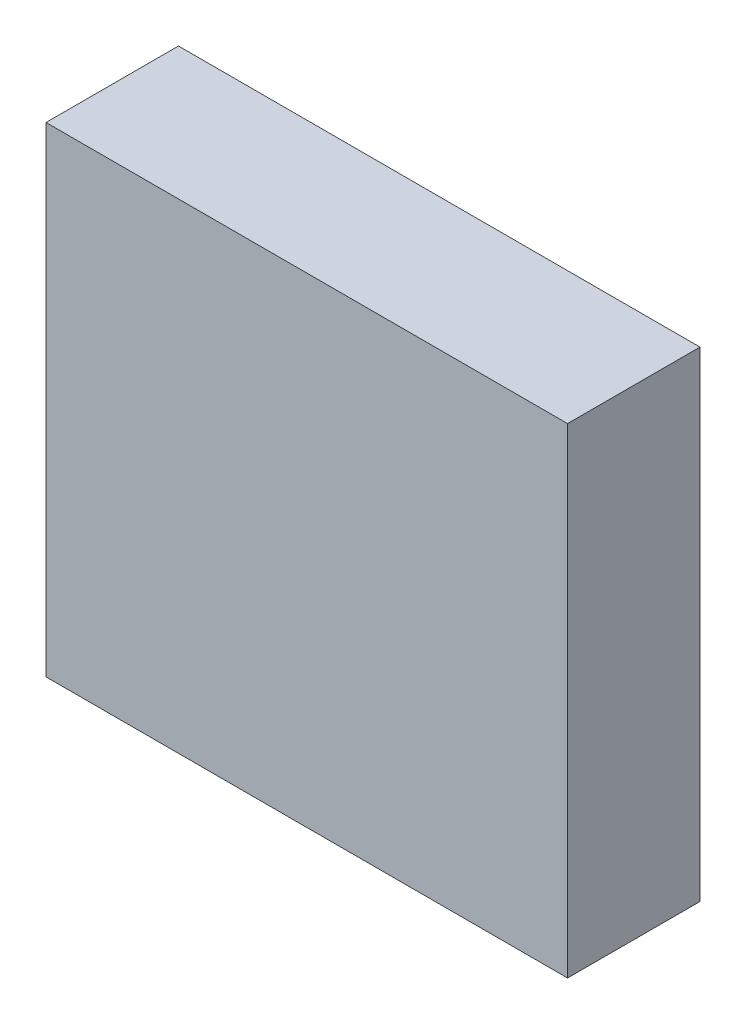
ISO-10303-21;
HEADER;
FILE_DESCRIPTION(('STEP AP214'),'2;1');
FILE_NAME('part.step','',(''),(''),'','','');
FILE_SCHEMA(('AUTOMOTIVE_DESIGN { 1 0 10303 214 1 1 1 1 }'));
ENDSEC;
DATA;
#1=APPLICATION_CONTEXT('core data for automotive mechanical design processes');
#2=APPLICATION_PROTOCOL_DEFINITION('international standard','automotive_design',2000,#1);
#3=PRODUCT_CONTEXT('',#1,'mechanical');
#4=PRODUCT('Part','Part','',(#3));
#5=PRODUCT_RELATED_PRODUCT_CATEGORY('part','',(#4));
#6=PRODUCT_DEFINITION_FORMATION('','',#4);
#7=PRODUCT_DEFINITION_CONTEXT('part definition',#1,'design');
#8=PRODUCT_DEFINITION('design','',#6,#7);
#9=PRODUCT_DEFINITION_SHAPE('','',#8);
#10=(LENGTH_UNIT() NAMED_UNIT(*) SI_UNIT(.MILLI.,.METRE.));
#11=(NAMED_UNIT(*) PLANE_ANGLE_UNIT() SI_UNIT($,.RADIAN.));
#12=(NAMED_UNIT(*) SI_UNIT($,.STERADIAN.) SOLID_ANGLE_UNIT());
#13=UNCERTAINTY_MEASURE_WITH_UNIT(LENGTH_MEASURE(1.E-05),#10,'distance_accuracy_value','');
#14=(GEOMETRIC_REPRESENTATION_CONTEXT(3) GLOBAL_UNCERTAINTY_ASSIGNED_CONTEXT((#13)) GLOBAL_UNIT_ASSIGNED_CONTEXT((#10,
#11,#12)) REPRESENTATION_CONTEXT('',''));
#15=CARTESIAN_POINT('',(0.,0.,0.));
#16=DIRECTION('',(0.,0.,1.));
#17=DIRECTION('',(1.,0.,0.));
#18=AXIS2_PLACEMENT_3D('',#15,#16,#17);
#19=CARTESIAN_POINT('',(0.,0.,16.));
#20=DIRECTION('',(0.,1.,0.));
#21=DIRECTION('',(0.,0.,1.));
#22=AXIS2_PLACEMENT_3D('',#19,#20,#21);
#23=PLANE('',#22);
#24=DIRECTION('',(1.,0.,0.));
#25=VECTOR('',#24,1.);
#26=CARTESIAN_POINT('',(0.,0.,0.));
#27=LINE('',#26,#25);
#28=CARTESIAN_POINT('',(0.,0.,0.));
#29=VERTEX_POINT('',#28);
#30=CARTESIAN_POINT('',(63.,0.,0.));
#31=VERTEX_POINT('',#30);
#32=EDGE_CURVE('E95',#29,#31,#27,.T.);
#33=ORIENTED_EDGE('',*,*,#32,.T.);
#34=DIRECTION('',(0.,0.,-1.));
#35=VECTOR('',#34,1.);
#36=CARTESIAN_POINT('',(63.,0.,16.));
#37=LINE('',#36,#35);
#38=CARTESIAN_POINT('',(63.,0.,16.));
#39=VERTEX_POINT('',#38);
#40=EDGE_CURVE('E11',#39,#31,#37,.T.);
#41=ORIENTED_EDGE('',*,*,#40,.F.);
#42=DIRECTION('',(1.,0.,0.));
#43=VECTOR('',#42,1.);
#44=CARTESIAN_POINT('',(0.,0.,16.));
#45=LINE('',#44,#43);
#46=CARTESIAN_POINT('',(0.,0.,16.));
#47=VERTEX_POINT('',#46);
#48=EDGE_CURVE('E83',#47,#39,#45,.T.);
#49=ORIENTED_EDGE('',*,*,#48,.F.);
#50=DIRECTION('',(0.,0.,-1.));
#51=VECTOR('',#50,1.);
#52=CARTESIAN_POINT('',(0.,0.,16.));
#53=LINE('',#52,#51);
#54=EDGE_CURVE('E91',#47,#29,#53,.T.);
#55=ORIENTED_EDGE('',*,*,#54,.T.);
#56=EDGE_LOOP('',(#33,#41,#49,#55));
#57=FACE_BOUND('',#56,.T.);
#58=ADVANCED_FACE('F32',(#57),#23,.F.);
#59=CARTESIAN_POINT('',(63.,0.,16.));
#60=DIRECTION('',(-1.,0.,0.));
#61=DIRECTION('',(0.,0.,1.));
#62=AXIS2_PLACEMENT_3D('',#59,#60,#61);
#63=PLANE('',#62);
#64=DIRECTION('',(0.,1.,0.));
#65=VECTOR('',#64,1.);
#66=CARTESIAN_POINT('',(63.,0.,0.));
#67=LINE('',#66,#65);
#68=CARTESIAN_POINT('',(63.,58.,0.));
#69=VERTEX_POINT('',#68);
#70=EDGE_CURVE('E87',#31,#69,#67,.T.);
#71=ORIENTED_EDGE('',*,*,#70,.T.);
#72=DIRECTION('',(0.,0.,-1.));
#73=VECTOR('',#72,1.);
#74=CARTESIAN_POINT('',(63.,58.,16.));
#75=LINE('',#74,#73);
#76=CARTESIAN_POINT('',(63.,58.,16.));
#77=VERTEX_POINT('',#76);
#78=EDGE_CURVE('E40',#77,#69,#75,.T.);
#79=ORIENTED_EDGE('',*,*,#78,.F.);
#80=DIRECTION('',(0.,1.,0.));
#81=VECTOR('',#80,1.);
#82=CARTESIAN_POINT('',(63.,0.,16.));
#83=LINE('',#82,#81);
#84=EDGE_CURVE('E78',#39,#77,#83,.T.);
#85=ORIENTED_EDGE('',*,*,#84,.F.);
#86=ORIENTED_EDGE('',*,*,#40,.T.);
#87=EDGE_LOOP('',(#71,#79,#85,#86));
#88=FACE_BOUND('',#87,.T.);
#89=ADVANCED_FACE('F86',(#88),#63,.F.);
#90=CARTESIAN_POINT('',(63.,58.,16.));
#91=DIRECTION('',(0.,-1.,0.));
#92=DIRECTION('',(0.,0.,-1.));
#93=AXIS2_PLACEMENT_3D('',#90,#91,#92);
#94=PLANE('',#93);
#95=DIRECTION('',(-1.,0.,0.));
#96=VECTOR('',#95,1.);
#97=CARTESIAN_POINT('',(63.,58.,0.));
#98=LINE('',#97,#96);
#99=CARTESIAN_POINT('',(0.,58.,0.));
#100=VERTEX_POINT('',#99);
#101=EDGE_CURVE('E65',#69,#100,#98,.T.);
#102=ORIENTED_EDGE('',*,*,#101,.T.);
#103=DIRECTION('',(0.,0.,-1.));
#104=VECTOR('',#103,1.);
#105=CARTESIAN_POINT('',(0.,58.,16.));
#106=LINE('',#105,#104);
#107=CARTESIAN_POINT('',(0.,58.,16.));
#108=VERTEX_POINT('',#107);
#109=EDGE_CURVE('E88',#108,#100,#106,.T.);
#110=ORIENTED_EDGE('',*,*,#109,.F.);
#111=DIRECTION('',(-1.,0.,0.));
#112=VECTOR('',#111,1.);
#113=CARTESIAN_POINT('',(63.,58.,16.));
#114=LINE('',#113,#112);
#115=EDGE_CURVE('E81',#77,#108,#114,.T.);
#116=ORIENTED_EDGE('',*,*,#115,.F.);
#117=ORIENTED_EDGE('',*,*,#78,.T.);
#118=EDGE_LOOP('',(#102,#110,#116,#117));
#119=FACE_BOUND('',#118,.T.);
#120=ADVANCED_FACE('F89',(#119),#94,.F.);
#121=CARTESIAN_POINT('',(0.,0.,16.));
#122=DIRECTION('',(1.,0.,0.));
#123=DIRECTION('',(0.,0.,-1.));
#124=AXIS2_PLACEMENT_3D('',#121,#122,#123);
#125=PLANE('',#124);
#126=DIRECTION('',(0.,-1.,0.));
#127=VECTOR('',#126,1.);
#128=CARTESIAN_POINT('',(0.,0.,0.));
#129=LINE('',#128,#127);
#130=EDGE_CURVE('E71',#100,#29,#129,.T.);
#131=ORIENTED_EDGE('',*,*,#130,.T.);
#132=ORIENTED_EDGE('',*,*,#54,.F.);
#133=DIRECTION('',(0.,-1.,0.));
#134=VECTOR('',#133,1.);
#135=CARTESIAN_POINT('',(0.,0.,16.));
#136=LINE('',#135,#134);
#137=EDGE_CURVE('E48',#108,#47,#136,.T.);
#138=ORIENTED_EDGE('',*,*,#137,.F.);
#139=ORIENTED_EDGE('',*,*,#109,.T.);
#140=EDGE_LOOP('',(#131,#132,#138,#139));
#141=FACE_BOUND('',#140,.T.);
#142=ADVANCED_FACE('F102',(#141),#125,.F.);
#143=CARTESIAN_POINT('',(0.,0.,16.));
#144=DIRECTION('',(0.,0.,1.));
#145=DIRECTION('',(1.,0.,0.));
#146=AXIS2_PLACEMENT_3D('',#143,#144,#145);
#147=PLANE('',#146);
#148=ORIENTED_EDGE('',*,*,#48,.T.);
#149=ORIENTED_EDGE('',*,*,#84,.T.);
#150=ORIENTED_EDGE('',*,*,#115,.T.);
#151=ORIENTED_EDGE('',*,*,#137,.T.);
#152=EDGE_LOOP('',(#148,#149,#150,#151));
#153=FACE_BOUND('',#152,.T.);
#154=ADVANCED_FACE('F79',(#153),#147,.T.);
#155=CARTESIAN_POINT('',(0.,0.,0.));
#156=DIRECTION('',(0.,0.,1.));
#157=DIRECTION('',(1.,0.,0.));
#158=AXIS2_PLACEMENT_3D('',#155,#156,#157);
#159=PLANE('',#158);
#160=ORIENTED_EDGE('',*,*,#32,.F.);
#161=ORIENTED_EDGE('',*,*,#130,.F.);
#162=ORIENTED_EDGE('',*,*,#101,.F.);
#163=ORIENTED_EDGE('',*,*,#70,.F.);
#164=EDGE_LOOP('',(#160,#161,#162,#163));
#165=FACE_BOUND('',#164,.T.);
#166=ADVANCED_FACE('F105',(#165),#159,.F.);
#167=CLOSED_SHELL('',(#58,#89,#120,#142,#154,#166));
#168=MANIFOLD_SOLID_BREP('B2',#167);
#169=ADVANCED_BREP_SHAPE_REPRESENTATION('',(#18,#168),#14);
#170=SHAPE_DEFINITION_REPRESENTATION(#9,#169);
ENDSEC;
END-ISO-10303-21;
